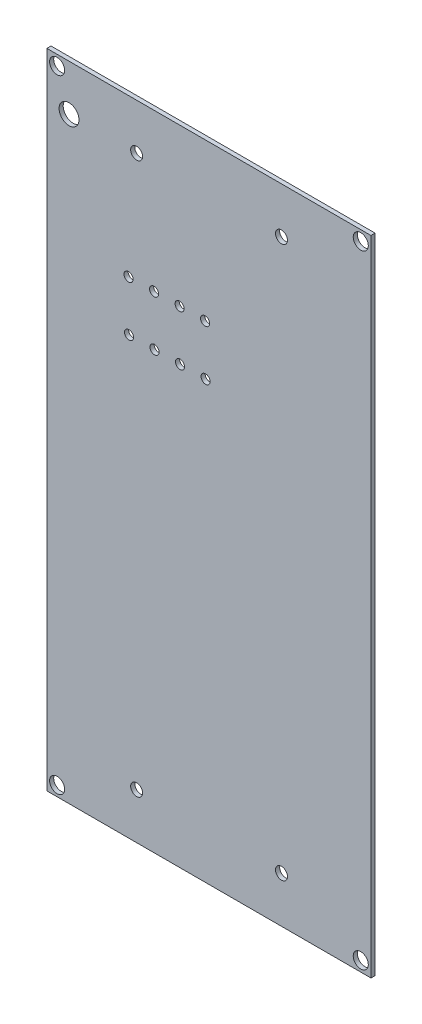
ISO-10303-21;
HEADER;
FILE_DESCRIPTION(('STEP AP214'),'2;1');
FILE_NAME('part.step','',(''),(''),'','','');
FILE_SCHEMA(('AUTOMOTIVE_DESIGN { 1 0 10303 214 1 1 1 1 }'));
ENDSEC;
DATA;
#1=APPLICATION_CONTEXT('core data for automotive mechanical design processes');
#2=APPLICATION_PROTOCOL_DEFINITION('international standard','automotive_design',2000,#1);
#3=PRODUCT_CONTEXT('',#1,'mechanical');
#4=PRODUCT('Part','Part','',(#3));
#5=PRODUCT_RELATED_PRODUCT_CATEGORY('part','',(#4));
#6=PRODUCT_DEFINITION_FORMATION('','',#4);
#7=PRODUCT_DEFINITION_CONTEXT('part definition',#1,'design');
#8=PRODUCT_DEFINITION('design','',#6,#7);
#9=PRODUCT_DEFINITION_SHAPE('','',#8);
#10=(LENGTH_UNIT() NAMED_UNIT(*) SI_UNIT(.MILLI.,.METRE.));
#11=(NAMED_UNIT(*) PLANE_ANGLE_UNIT() SI_UNIT($,.RADIAN.));
#12=(NAMED_UNIT(*) SI_UNIT($,.STERADIAN.) SOLID_ANGLE_UNIT());
#13=UNCERTAINTY_MEASURE_WITH_UNIT(LENGTH_MEASURE(1.E-05),#10,'distance_accuracy_value','');
#14=(GEOMETRIC_REPRESENTATION_CONTEXT(3) GLOBAL_UNCERTAINTY_ASSIGNED_CONTEXT((#13)) GLOBAL_UNIT_ASSIGNED_CONTEXT((#10,
#11,#12)) REPRESENTATION_CONTEXT('',''));
#15=CARTESIAN_POINT('',(0.,0.,0.));
#16=DIRECTION('',(0.,0.,1.));
#17=DIRECTION('',(1.,0.,0.));
#18=AXIS2_PLACEMENT_3D('',#15,#16,#17);
#19=CARTESIAN_POINT('',(4.82600021362305,1.26999998092651,0.));
#20=DIRECTION('',(-1.,0.,0.));
#21=DIRECTION('',(0.,1.,0.));
#22=AXIS2_PLACEMENT_3D('',#19,#20,#21);
#23=PLANE('',#22);
#24=DIRECTION('',(0.,0.,1.));
#25=VECTOR('',#24,1.);
#26=CARTESIAN_POINT('',(4.82600021362305,1.26999998092651,0.));
#27=LINE('',#26,#25);
#28=CARTESIAN_POINT('',(4.82600021362305,1.26999998092651,0.));
#29=VERTEX_POINT('',#28);
#30=CARTESIAN_POINT('',(4.82600021362305,1.26999998092651,0.41148));
#31=VERTEX_POINT('',#30);
#32=EDGE_CURVE('E11',#29,#31,#27,.T.);
#33=ORIENTED_EDGE('',*,*,#32,.T.);
#34=DIRECTION('',(0.,1.,0.));
#35=VECTOR('',#34,1.);
#36=CARTESIAN_POINT('',(4.82600021362305,1.26999998092651,0.41148));
#37=LINE('',#36,#35);
#38=CARTESIAN_POINT('',(4.82600021362305,64.0080032348633,0.41148));
#39=VERTEX_POINT('',#38);
#40=EDGE_CURVE('E24',#31,#39,#37,.T.);
#41=ORIENTED_EDGE('',*,*,#40,.T.);
#42=DIRECTION('',(0.,0.,1.));
#43=VECTOR('',#42,1.);
#44=CARTESIAN_POINT('',(4.82600021362305,64.0080032348633,0.));
#45=LINE('',#44,#43);
#46=CARTESIAN_POINT('',(4.82600021362305,64.0080032348633,0.));
#47=VERTEX_POINT('',#46);
#48=EDGE_CURVE('E335',#47,#39,#45,.T.);
#49=ORIENTED_EDGE('',*,*,#48,.F.);
#50=DIRECTION('',(0.,1.,0.));
#51=VECTOR('',#50,1.);
#52=CARTESIAN_POINT('',(4.82600021362305,1.26999998092651,0.));
#53=LINE('',#52,#51);
#54=EDGE_CURVE('E332',#29,#47,#53,.T.);
#55=ORIENTED_EDGE('',*,*,#54,.F.);
#56=EDGE_LOOP('',(#33,#41,#49,#55));
#57=FACE_BOUND('',#56,.T.);
#58=ADVANCED_FACE('F17',(#57),#23,.T.);
#59=CARTESIAN_POINT('',(4.82600021362305,64.0080032348633,0.));
#60=DIRECTION('',(0.,1.,0.));
#61=DIRECTION('',(1.,0.,0.));
#62=AXIS2_PLACEMENT_3D('',#59,#60,#61);
#63=PLANE('',#62);
#64=ORIENTED_EDGE('',*,*,#48,.T.);
#65=DIRECTION('',(1.,0.,0.));
#66=VECTOR('',#65,1.);
#67=CARTESIAN_POINT('',(4.82600021362305,64.0080032348633,0.41148));
#68=LINE('',#67,#66);
#69=CARTESIAN_POINT('',(37.0839996337891,64.0080032348633,0.41148));
#70=VERTEX_POINT('',#69);
#71=EDGE_CURVE('E329',#39,#70,#68,.T.);
#72=ORIENTED_EDGE('',*,*,#71,.T.);
#73=DIRECTION('',(0.,0.,1.));
#74=VECTOR('',#73,1.);
#75=CARTESIAN_POINT('',(37.0839996337891,64.0080032348633,0.));
#76=LINE('',#75,#74);
#77=CARTESIAN_POINT('',(37.0839996337891,64.0080032348633,0.));
#78=VERTEX_POINT('',#77);
#79=EDGE_CURVE('E327',#78,#70,#76,.T.);
#80=ORIENTED_EDGE('',*,*,#79,.F.);
#81=DIRECTION('',(1.,0.,0.));
#82=VECTOR('',#81,1.);
#83=CARTESIAN_POINT('',(4.82600021362305,64.0080032348633,0.));
#84=LINE('',#83,#82);
#85=EDGE_CURVE('E324',#47,#78,#84,.T.);
#86=ORIENTED_EDGE('',*,*,#85,.F.);
#87=EDGE_LOOP('',(#64,#72,#80,#86));
#88=FACE_BOUND('',#87,.T.);
#89=ADVANCED_FACE('F344',(#88),#63,.T.);
#90=CARTESIAN_POINT('',(37.0839996337891,64.0080032348633,0.));
#91=DIRECTION('',(1.,0.,0.));
#92=DIRECTION('',(0.,-1.,0.));
#93=AXIS2_PLACEMENT_3D('',#90,#91,#92);
#94=PLANE('',#93);
#95=ORIENTED_EDGE('',*,*,#79,.T.);
#96=DIRECTION('',(0.,-1.,0.));
#97=VECTOR('',#96,1.);
#98=CARTESIAN_POINT('',(37.0839996337891,64.0080032348633,0.41148));
#99=LINE('',#98,#97);
#100=CARTESIAN_POINT('',(37.0839996337891,0.,0.41148));
#101=VERTEX_POINT('',#100);
#102=EDGE_CURVE('E321',#70,#101,#99,.T.);
#103=ORIENTED_EDGE('',*,*,#102,.T.);
#104=DIRECTION('',(0.,0.,1.));
#105=VECTOR('',#104,1.);
#106=CARTESIAN_POINT('',(37.0839996337891,0.,0.));
#107=LINE('',#106,#105);
#108=CARTESIAN_POINT('',(37.0839996337891,0.,0.));
#109=VERTEX_POINT('',#108);
#110=EDGE_CURVE('E319',#109,#101,#107,.T.);
#111=ORIENTED_EDGE('',*,*,#110,.F.);
#112=DIRECTION('',(0.,-1.,0.));
#113=VECTOR('',#112,1.);
#114=CARTESIAN_POINT('',(37.0839996337891,64.0080032348633,0.));
#115=LINE('',#114,#113);
#116=EDGE_CURVE('E316',#78,#109,#115,.T.);
#117=ORIENTED_EDGE('',*,*,#116,.F.);
#118=EDGE_LOOP('',(#95,#103,#111,#117));
#119=FACE_BOUND('',#118,.T.);
#120=ADVANCED_FACE('F351',(#119),#94,.T.);
#121=CARTESIAN_POINT('',(37.0839996337891,0.,0.));
#122=DIRECTION('',(0.,-1.,0.));
#123=DIRECTION('',(-1.,0.,0.));
#124=AXIS2_PLACEMENT_3D('',#121,#122,#123);
#125=PLANE('',#124);
#126=ORIENTED_EDGE('',*,*,#110,.T.);
#127=DIRECTION('',(-1.,0.,0.));
#128=VECTOR('',#127,1.);
#129=CARTESIAN_POINT('',(37.0839996337891,0.,0.41148));
#130=LINE('',#129,#128);
#131=CARTESIAN_POINT('',(4.82600021362305,0.,0.41148));
#132=VERTEX_POINT('',#131);
#133=EDGE_CURVE('E313',#101,#132,#130,.T.);
#134=ORIENTED_EDGE('',*,*,#133,.T.);
#135=DIRECTION('',(0.,0.,1.));
#136=VECTOR('',#135,1.);
#137=CARTESIAN_POINT('',(4.82600021362305,0.,0.));
#138=LINE('',#137,#136);
#139=CARTESIAN_POINT('',(4.82600021362305,0.,0.));
#140=VERTEX_POINT('',#139);
#141=EDGE_CURVE('E311',#140,#132,#138,.T.);
#142=ORIENTED_EDGE('',*,*,#141,.F.);
#143=DIRECTION('',(-1.,0.,0.));
#144=VECTOR('',#143,1.);
#145=CARTESIAN_POINT('',(37.0839996337891,0.,0.));
#146=LINE('',#145,#144);
#147=EDGE_CURVE('E308',#109,#140,#146,.T.);
#148=ORIENTED_EDGE('',*,*,#147,.F.);
#149=EDGE_LOOP('',(#126,#134,#142,#148));
#150=FACE_BOUND('',#149,.T.);
#151=ADVANCED_FACE('F353',(#150),#125,.T.);
#152=CARTESIAN_POINT('',(4.82600021362305,0.,0.));
#153=DIRECTION('',(-1.,0.,0.));
#154=DIRECTION('',(0.,1.,0.));
#155=AXIS2_PLACEMENT_3D('',#152,#153,#154);
#156=PLANE('',#155);
#157=ORIENTED_EDGE('',*,*,#141,.T.);
#158=DIRECTION('',(0.,1.,0.));
#159=VECTOR('',#158,1.);
#160=CARTESIAN_POINT('',(4.82600021362305,0.,0.41148));
#161=LINE('',#160,#159);
#162=EDGE_CURVE('E306',#132,#31,#161,.T.);
#163=ORIENTED_EDGE('',*,*,#162,.T.);
#164=ORIENTED_EDGE('',*,*,#32,.F.);
#165=DIRECTION('',(0.,1.,0.));
#166=VECTOR('',#165,1.);
#167=CARTESIAN_POINT('',(4.82600021362305,0.,0.));
#168=LINE('',#167,#166);
#169=EDGE_CURVE('E303',#140,#29,#168,.T.);
#170=ORIENTED_EDGE('',*,*,#169,.F.);
#171=EDGE_LOOP('',(#157,#163,#164,#170));
#172=FACE_BOUND('',#171,.T.);
#173=ADVANCED_FACE('F354',(#172),#156,.T.);
#174=CARTESIAN_POINT('',(5.84198475999999,1.01598476,0.));
#175=DIRECTION('',(0.,0.,-1.));
#176=DIRECTION('',(1.,0.,0.));
#177=AXIS2_PLACEMENT_3D('',#174,#175,#176);
#178=CYLINDRICAL_SURFACE('',#177,0.7499985);
#179=DIRECTION('',(0.,0.,1.));
#180=VECTOR('',#179,1.);
#181=CARTESIAN_POINT('',(6.59198325999999,1.01598476,0.));
#182=LINE('',#181,#180);
#183=CARTESIAN_POINT('',(6.59198325999999,1.01598476,0.));
#184=VERTEX_POINT('',#183);
#185=CARTESIAN_POINT('',(6.59198325999999,1.01598476,0.41148));
#186=VERTEX_POINT('',#185);
#187=EDGE_CURVE('E301',#184,#186,#182,.T.);
#188=ORIENTED_EDGE('',*,*,#187,.T.);
#189=CARTESIAN_POINT('',(5.84198475999999,1.01598476,0.41148));
#190=DIRECTION('',(0.,0.,1.));
#191=DIRECTION('',(1.,0.,0.));
#192=AXIS2_PLACEMENT_3D('',#189,#190,#191);
#193=CIRCLE('',#192,0.7499985);
#194=EDGE_CURVE('E298',#186,#186,#193,.T.);
#195=ORIENTED_EDGE('',*,*,#194,.T.);
#196=ORIENTED_EDGE('',*,*,#187,.F.);
#197=CARTESIAN_POINT('',(5.84198475999999,1.01598476,0.));
#198=DIRECTION('',(0.,0.,1.));
#199=DIRECTION('',(1.,0.,0.));
#200=AXIS2_PLACEMENT_3D('',#197,#198,#199);
#201=CIRCLE('',#200,0.7499985);
#202=EDGE_CURVE('E295',#184,#184,#201,.T.);
#203=ORIENTED_EDGE('',*,*,#202,.F.);
#204=EDGE_LOOP('',(#188,#195,#196,#203));
#205=FACE_BOUND('',#204,.T.);
#206=ADVANCED_FACE('F356',(#205),#178,.F.);
#207=CARTESIAN_POINT('',(12.95403556,48.38703556,0.));
#208=DIRECTION('',(0.,0.,-1.));
#209=DIRECTION('',(1.,0.,0.));
#210=AXIS2_PLACEMENT_3D('',#207,#208,#209);
#211=CYLINDRICAL_SURFACE('',#210,0.4499991);
#212=DIRECTION('',(0.,0.,1.));
#213=VECTOR('',#212,1.);
#214=CARTESIAN_POINT('',(13.40403466,48.38703556,0.));
#215=LINE('',#214,#213);
#216=CARTESIAN_POINT('',(13.40403466,48.38703556,0.));
#217=VERTEX_POINT('',#216);
#218=CARTESIAN_POINT('',(13.40403466,48.38703556,0.41148));
#219=VERTEX_POINT('',#218);
#220=EDGE_CURVE('E293',#217,#219,#215,.T.);
#221=ORIENTED_EDGE('',*,*,#220,.T.);
#222=CARTESIAN_POINT('',(12.95403556,48.38703556,0.41148));
#223=DIRECTION('',(0.,0.,1.));
#224=DIRECTION('',(1.,0.,0.));
#225=AXIS2_PLACEMENT_3D('',#222,#223,#224);
#226=CIRCLE('',#225,0.4499991);
#227=EDGE_CURVE('E290',#219,#219,#226,.T.);
#228=ORIENTED_EDGE('',*,*,#227,.T.);
#229=ORIENTED_EDGE('',*,*,#220,.F.);
#230=CARTESIAN_POINT('',(12.95403556,48.38703556,0.));
#231=DIRECTION('',(0.,0.,1.));
#232=DIRECTION('',(1.,0.,0.));
#233=AXIS2_PLACEMENT_3D('',#230,#231,#232);
#234=CIRCLE('',#233,0.4499991);
#235=EDGE_CURVE('E287',#217,#217,#234,.T.);
#236=ORIENTED_EDGE('',*,*,#235,.F.);
#237=EDGE_LOOP('',(#221,#228,#229,#236));
#238=FACE_BOUND('',#237,.T.);
#239=ADVANCED_FACE('F363',(#238),#211,.F.);
#240=CARTESIAN_POINT('',(13.75835196,4.57772516,0.));
#241=DIRECTION('',(0.,0.,-1.));
#242=DIRECTION('',(1.,0.,0.));
#243=AXIS2_PLACEMENT_3D('',#240,#241,#242);
#244=CYLINDRICAL_SURFACE('',#243,0.59500008);
#245=DIRECTION('',(0.,0.,1.));
#246=VECTOR('',#245,1.);
#247=CARTESIAN_POINT('',(14.35335204,4.57772516,0.));
#248=LINE('',#247,#246);
#249=CARTESIAN_POINT('',(14.35335204,4.57772516,0.));
#250=VERTEX_POINT('',#249);
#251=CARTESIAN_POINT('',(14.35335204,4.57772516,0.41148));
#252=VERTEX_POINT('',#251);
#253=EDGE_CURVE('E285',#250,#252,#248,.T.);
#254=ORIENTED_EDGE('',*,*,#253,.T.);
#255=CARTESIAN_POINT('',(13.75835196,4.57772516,0.41148));
#256=DIRECTION('',(0.,0.,1.));
#257=DIRECTION('',(1.,0.,0.));
#258=AXIS2_PLACEMENT_3D('',#255,#256,#257);
#259=CIRCLE('',#258,0.59500008);
#260=EDGE_CURVE('E282',#252,#252,#259,.T.);
#261=ORIENTED_EDGE('',*,*,#260,.T.);
#262=ORIENTED_EDGE('',*,*,#253,.F.);
#263=CARTESIAN_POINT('',(13.75835196,4.57772516,0.));
#264=DIRECTION('',(0.,0.,1.));
#265=DIRECTION('',(1.,0.,0.));
#266=AXIS2_PLACEMENT_3D('',#263,#264,#265);
#267=CIRCLE('',#266,0.59500008);
#268=EDGE_CURVE('E279',#250,#250,#267,.T.);
#269=ORIENTED_EDGE('',*,*,#268,.F.);
#270=EDGE_LOOP('',(#254,#261,#262,#269));
#271=FACE_BOUND('',#270,.T.);
#272=ADVANCED_FACE('F408',(#271),#244,.F.);
#273=CARTESIAN_POINT('',(13.00000956,43.39999956,0.));
#274=DIRECTION('',(0.,0.,-1.));
#275=DIRECTION('',(1.,0.,0.));
#276=AXIS2_PLACEMENT_3D('',#273,#274,#275);
#277=CYLINDRICAL_SURFACE('',#276,0.4499991);
#278=DIRECTION('',(0.,0.,1.));
#279=VECTOR('',#278,1.);
#280=CARTESIAN_POINT('',(13.45000866,43.39999956,0.));
#281=LINE('',#280,#279);
#282=CARTESIAN_POINT('',(13.45000866,43.39999956,0.));
#283=VERTEX_POINT('',#282);
#284=CARTESIAN_POINT('',(13.45000866,43.39999956,0.41148));
#285=VERTEX_POINT('',#284);
#286=EDGE_CURVE('E277',#283,#285,#281,.T.);
#287=ORIENTED_EDGE('',*,*,#286,.T.);
#288=CARTESIAN_POINT('',(13.00000956,43.39999956,0.41148));
#289=DIRECTION('',(0.,0.,1.));
#290=DIRECTION('',(1.,0.,0.));
#291=AXIS2_PLACEMENT_3D('',#288,#289,#290);
#292=CIRCLE('',#291,0.4499991);
#293=EDGE_CURVE('E274',#285,#285,#292,.T.);
#294=ORIENTED_EDGE('',*,*,#293,.T.);
#295=ORIENTED_EDGE('',*,*,#286,.F.);
#296=CARTESIAN_POINT('',(13.00000956,43.39999956,0.));
#297=DIRECTION('',(0.,0.,1.));
#298=DIRECTION('',(1.,0.,0.));
#299=AXIS2_PLACEMENT_3D('',#296,#297,#298);
#300=CIRCLE('',#299,0.4499991);
#301=EDGE_CURVE('E271',#283,#283,#300,.T.);
#302=ORIENTED_EDGE('',*,*,#301,.F.);
#303=EDGE_LOOP('',(#287,#294,#295,#302));
#304=FACE_BOUND('',#303,.T.);
#305=ADVANCED_FACE('F418',(#304),#277,.F.);
#306=CARTESIAN_POINT('',(7.02836795999998,59.43776276,0.));
#307=DIRECTION('',(0.,0.,-1.));
#308=DIRECTION('',(1.,0.,0.));
#309=AXIS2_PLACEMENT_3D('',#306,#307,#308);
#310=CYLINDRICAL_SURFACE('',#309,0.99000056);
#311=DIRECTION('',(0.,0.,1.));
#312=VECTOR('',#311,1.);
#313=CARTESIAN_POINT('',(8.01836851999998,59.43776276,0.));
#314=LINE('',#313,#312);
#315=CARTESIAN_POINT('',(8.01836851999998,59.43776276,0.));
#316=VERTEX_POINT('',#315);
#317=CARTESIAN_POINT('',(8.01836851999998,59.43776276,0.41148));
#318=VERTEX_POINT('',#317);
#319=EDGE_CURVE('E269',#316,#318,#314,.T.);
#320=ORIENTED_EDGE('',*,*,#319,.T.);
#321=CARTESIAN_POINT('',(7.02836795999998,59.43776276,0.41148));
#322=DIRECTION('',(0.,0.,1.));
#323=DIRECTION('',(1.,0.,0.));
#324=AXIS2_PLACEMENT_3D('',#321,#322,#323);
#325=CIRCLE('',#324,0.99000056);
#326=EDGE_CURVE('E266',#318,#318,#325,.T.);
#327=ORIENTED_EDGE('',*,*,#326,.T.);
#328=ORIENTED_EDGE('',*,*,#319,.F.);
#329=CARTESIAN_POINT('',(7.02836795999998,59.43776276,0.));
#330=DIRECTION('',(0.,0.,1.));
#331=DIRECTION('',(1.,0.,0.));
#332=AXIS2_PLACEMENT_3D('',#329,#330,#331);
#333=CIRCLE('',#332,0.99000056);
#334=EDGE_CURVE('E263',#316,#316,#333,.T.);
#335=ORIENTED_EDGE('',*,*,#334,.F.);
#336=EDGE_LOOP('',(#320,#327,#328,#335));
#337=FACE_BOUND('',#336,.T.);
#338=ADVANCED_FACE('F428',(#337),#310,.F.);
#339=CARTESIAN_POINT('',(5.84198475999999,62.99198476,0.));
#340=DIRECTION('',(0.,0.,-1.));
#341=DIRECTION('',(1.,0.,0.));
#342=AXIS2_PLACEMENT_3D('',#339,#340,#341);
#343=CYLINDRICAL_SURFACE('',#342,0.7499985);
#344=DIRECTION('',(0.,0.,1.));
#345=VECTOR('',#344,1.);
#346=CARTESIAN_POINT('',(6.59198325999999,62.99198476,0.));
#347=LINE('',#346,#345);
#348=CARTESIAN_POINT('',(6.59198325999999,62.99198476,0.));
#349=VERTEX_POINT('',#348);
#350=CARTESIAN_POINT('',(6.59198325999999,62.99198476,0.41148));
#351=VERTEX_POINT('',#350);
#352=EDGE_CURVE('E261',#349,#351,#347,.T.);
#353=ORIENTED_EDGE('',*,*,#352,.T.);
#354=CARTESIAN_POINT('',(5.84198475999999,62.99198476,0.41148));
#355=DIRECTION('',(0.,0.,1.));
#356=DIRECTION('',(1.,0.,0.));
#357=AXIS2_PLACEMENT_3D('',#354,#355,#356);
#358=CIRCLE('',#357,0.7499985);
#359=EDGE_CURVE('E258',#351,#351,#358,.T.);
#360=ORIENTED_EDGE('',*,*,#359,.T.);
#361=ORIENTED_EDGE('',*,*,#352,.F.);
#362=CARTESIAN_POINT('',(5.84198475999999,62.99198476,0.));
#363=DIRECTION('',(0.,0.,1.));
#364=DIRECTION('',(1.,0.,0.));
#365=AXIS2_PLACEMENT_3D('',#362,#363,#364);
#366=CIRCLE('',#365,0.7499985);
#367=EDGE_CURVE('E255',#349,#349,#366,.T.);
#368=ORIENTED_EDGE('',*,*,#367,.F.);
#369=EDGE_LOOP('',(#353,#360,#361,#368));
#370=FACE_BOUND('',#369,.T.);
#371=ADVANCED_FACE('F438',(#370),#343,.F.);
#372=CARTESIAN_POINT('',(15.49403556,48.38703556,0.));
#373=DIRECTION('',(0.,0.,-1.));
#374=DIRECTION('',(1.,0.,0.));
#375=AXIS2_PLACEMENT_3D('',#372,#373,#374);
#376=CYLINDRICAL_SURFACE('',#375,0.4499991);
#377=DIRECTION('',(0.,0.,1.));
#378=VECTOR('',#377,1.);
#379=CARTESIAN_POINT('',(15.94403466,48.38703556,0.));
#380=LINE('',#379,#378);
#381=CARTESIAN_POINT('',(15.94403466,48.38703556,0.));
#382=VERTEX_POINT('',#381);
#383=CARTESIAN_POINT('',(15.94403466,48.38703556,0.41148));
#384=VERTEX_POINT('',#383);
#385=EDGE_CURVE('E253',#382,#384,#380,.T.);
#386=ORIENTED_EDGE('',*,*,#385,.T.);
#387=CARTESIAN_POINT('',(15.49403556,48.38703556,0.41148));
#388=DIRECTION('',(0.,0.,1.));
#389=DIRECTION('',(1.,0.,0.));
#390=AXIS2_PLACEMENT_3D('',#387,#388,#389);
#391=CIRCLE('',#390,0.4499991);
#392=EDGE_CURVE('E250',#384,#384,#391,.T.);
#393=ORIENTED_EDGE('',*,*,#392,.T.);
#394=ORIENTED_EDGE('',*,*,#385,.F.);
#395=CARTESIAN_POINT('',(15.49403556,48.38703556,0.));
#396=DIRECTION('',(0.,0.,1.));
#397=DIRECTION('',(1.,0.,0.));
#398=AXIS2_PLACEMENT_3D('',#395,#396,#397);
#399=CIRCLE('',#398,0.4499991);
#400=EDGE_CURVE('E247',#382,#382,#399,.T.);
#401=ORIENTED_EDGE('',*,*,#400,.F.);
#402=EDGE_LOOP('',(#386,#393,#394,#401));
#403=FACE_BOUND('',#402,.T.);
#404=ADVANCED_FACE('F448',(#403),#376,.F.);
#405=CARTESIAN_POINT('',(13.75835196,59.43776276,0.));
#406=DIRECTION('',(0.,0.,-1.));
#407=DIRECTION('',(1.,0.,0.));
#408=AXIS2_PLACEMENT_3D('',#405,#406,#407);
#409=CYLINDRICAL_SURFACE('',#408,0.59500008);
#410=DIRECTION('',(0.,0.,1.));
#411=VECTOR('',#410,1.);
#412=CARTESIAN_POINT('',(14.35335204,59.43776276,0.));
#413=LINE('',#412,#411);
#414=CARTESIAN_POINT('',(14.35335204,59.43776276,0.));
#415=VERTEX_POINT('',#414);
#416=CARTESIAN_POINT('',(14.35335204,59.43776276,0.41148));
#417=VERTEX_POINT('',#416);
#418=EDGE_CURVE('E245',#415,#417,#413,.T.);
#419=ORIENTED_EDGE('',*,*,#418,.T.);
#420=CARTESIAN_POINT('',(13.75835196,59.43776276,0.41148));
#421=DIRECTION('',(0.,0.,1.));
#422=DIRECTION('',(1.,0.,0.));
#423=AXIS2_PLACEMENT_3D('',#420,#421,#422);
#424=CIRCLE('',#423,0.59500008);
#425=EDGE_CURVE('E242',#417,#417,#424,.T.);
#426=ORIENTED_EDGE('',*,*,#425,.T.);
#427=ORIENTED_EDGE('',*,*,#418,.F.);
#428=CARTESIAN_POINT('',(13.75835196,59.43776276,0.));
#429=DIRECTION('',(0.,0.,1.));
#430=DIRECTION('',(1.,0.,0.));
#431=AXIS2_PLACEMENT_3D('',#428,#429,#430);
#432=CIRCLE('',#431,0.59500008);
#433=EDGE_CURVE('E239',#415,#415,#432,.T.);
#434=ORIENTED_EDGE('',*,*,#433,.F.);
#435=EDGE_LOOP('',(#419,#426,#427,#434));
#436=FACE_BOUND('',#435,.T.);
#437=ADVANCED_FACE('F458',(#436),#409,.F.);
#438=CARTESIAN_POINT('',(18.08000956,43.39999956,0.));
#439=DIRECTION('',(0.,0.,-1.));
#440=DIRECTION('',(1.,0.,0.));
#441=AXIS2_PLACEMENT_3D('',#438,#439,#440);
#442=CYLINDRICAL_SURFACE('',#441,0.4499991);
#443=DIRECTION('',(0.,0.,1.));
#444=VECTOR('',#443,1.);
#445=CARTESIAN_POINT('',(18.53000866,43.39999956,0.));
#446=LINE('',#445,#444);
#447=CARTESIAN_POINT('',(18.53000866,43.39999956,0.));
#448=VERTEX_POINT('',#447);
#449=CARTESIAN_POINT('',(18.53000866,43.39999956,0.41148));
#450=VERTEX_POINT('',#449);
#451=EDGE_CURVE('E237',#448,#450,#446,.T.);
#452=ORIENTED_EDGE('',*,*,#451,.T.);
#453=CARTESIAN_POINT('',(18.08000956,43.39999956,0.41148));
#454=DIRECTION('',(0.,0.,1.));
#455=DIRECTION('',(1.,0.,0.));
#456=AXIS2_PLACEMENT_3D('',#453,#454,#455);
#457=CIRCLE('',#456,0.4499991);
#458=EDGE_CURVE('E234',#450,#450,#457,.T.);
#459=ORIENTED_EDGE('',*,*,#458,.T.);
#460=ORIENTED_EDGE('',*,*,#451,.F.);
#461=CARTESIAN_POINT('',(18.08000956,43.39999956,0.));
#462=DIRECTION('',(0.,0.,1.));
#463=DIRECTION('',(1.,0.,0.));
#464=AXIS2_PLACEMENT_3D('',#461,#462,#463);
#465=CIRCLE('',#464,0.4499991);
#466=EDGE_CURVE('E231',#448,#448,#465,.T.);
#467=ORIENTED_EDGE('',*,*,#466,.F.);
#468=EDGE_LOOP('',(#452,#459,#460,#467));
#469=FACE_BOUND('',#468,.T.);
#470=ADVANCED_FACE('F468',(#469),#442,.F.);
#471=CARTESIAN_POINT('',(15.54000956,43.39999956,0.));
#472=DIRECTION('',(0.,0.,-1.));
#473=DIRECTION('',(1.,0.,0.));
#474=AXIS2_PLACEMENT_3D('',#471,#472,#473);
#475=CYLINDRICAL_SURFACE('',#474,0.4499991);
#476=DIRECTION('',(0.,0.,1.));
#477=VECTOR('',#476,1.);
#478=CARTESIAN_POINT('',(15.99000866,43.39999956,0.));
#479=LINE('',#478,#477);
#480=CARTESIAN_POINT('',(15.99000866,43.39999956,0.));
#481=VERTEX_POINT('',#480);
#482=CARTESIAN_POINT('',(15.99000866,43.39999956,0.41148));
#483=VERTEX_POINT('',#482);
#484=EDGE_CURVE('E229',#481,#483,#479,.T.);
#485=ORIENTED_EDGE('',*,*,#484,.T.);
#486=CARTESIAN_POINT('',(15.54000956,43.39999956,0.41148));
#487=DIRECTION('',(0.,0.,1.));
#488=DIRECTION('',(1.,0.,0.));
#489=AXIS2_PLACEMENT_3D('',#486,#487,#488);
#490=CIRCLE('',#489,0.4499991);
#491=EDGE_CURVE('E226',#483,#483,#490,.T.);
#492=ORIENTED_EDGE('',*,*,#491,.T.);
#493=ORIENTED_EDGE('',*,*,#484,.F.);
#494=CARTESIAN_POINT('',(15.54000956,43.39999956,0.));
#495=DIRECTION('',(0.,0.,1.));
#496=DIRECTION('',(1.,0.,0.));
#497=AXIS2_PLACEMENT_3D('',#494,#495,#496);
#498=CIRCLE('',#497,0.4499991);
#499=EDGE_CURVE('E223',#481,#481,#498,.T.);
#500=ORIENTED_EDGE('',*,*,#499,.F.);
#501=EDGE_LOOP('',(#485,#492,#493,#500));
#502=FACE_BOUND('',#501,.T.);
#503=ADVANCED_FACE('F478',(#502),#475,.F.);
#504=CARTESIAN_POINT('',(36.06798476,1.01598476,0.));
#505=DIRECTION('',(0.,0.,-1.));
#506=DIRECTION('',(1.,0.,0.));
#507=AXIS2_PLACEMENT_3D('',#504,#505,#506);
#508=CYLINDRICAL_SURFACE('',#507,0.7499985);
#509=DIRECTION('',(0.,0.,1.));
#510=VECTOR('',#509,1.);
#511=CARTESIAN_POINT('',(36.81798326,1.01598476,0.));
#512=LINE('',#511,#510);
#513=CARTESIAN_POINT('',(36.81798326,1.01598476,0.));
#514=VERTEX_POINT('',#513);
#515=CARTESIAN_POINT('',(36.81798326,1.01598476,0.41148));
#516=VERTEX_POINT('',#515);
#517=EDGE_CURVE('E221',#514,#516,#512,.T.);
#518=ORIENTED_EDGE('',*,*,#517,.T.);
#519=CARTESIAN_POINT('',(36.06798476,1.01598476,0.41148));
#520=DIRECTION('',(0.,0.,1.));
#521=DIRECTION('',(1.,0.,0.));
#522=AXIS2_PLACEMENT_3D('',#519,#520,#521);
#523=CIRCLE('',#522,0.7499985);
#524=EDGE_CURVE('E218',#516,#516,#523,.T.);
#525=ORIENTED_EDGE('',*,*,#524,.T.);
#526=ORIENTED_EDGE('',*,*,#517,.F.);
#527=CARTESIAN_POINT('',(36.06798476,1.01598476,0.));
#528=DIRECTION('',(0.,0.,1.));
#529=DIRECTION('',(1.,0.,0.));
#530=AXIS2_PLACEMENT_3D('',#527,#528,#529);
#531=CIRCLE('',#530,0.7499985);
#532=EDGE_CURVE('E215',#514,#514,#531,.T.);
#533=ORIENTED_EDGE('',*,*,#532,.F.);
#534=EDGE_LOOP('',(#518,#525,#526,#533));
#535=FACE_BOUND('',#534,.T.);
#536=ADVANCED_FACE('F488',(#535),#508,.F.);
#537=CARTESIAN_POINT('',(28.17838916,4.57772516,0.));
#538=DIRECTION('',(0.,0.,-1.));
#539=DIRECTION('',(1.,0.,0.));
#540=AXIS2_PLACEMENT_3D('',#537,#538,#539);
#541=CYLINDRICAL_SURFACE('',#540,0.59500008);
#542=DIRECTION('',(0.,0.,1.));
#543=VECTOR('',#542,1.);
#544=CARTESIAN_POINT('',(28.77338924,4.57772516,0.));
#545=LINE('',#544,#543);
#546=CARTESIAN_POINT('',(28.77338924,4.57772516,0.));
#547=VERTEX_POINT('',#546);
#548=CARTESIAN_POINT('',(28.77338924,4.57772516,0.41148));
#549=VERTEX_POINT('',#548);
#550=EDGE_CURVE('E213',#547,#549,#545,.T.);
#551=ORIENTED_EDGE('',*,*,#550,.T.);
#552=CARTESIAN_POINT('',(28.17838916,4.57772516,0.41148));
#553=DIRECTION('',(0.,0.,1.));
#554=DIRECTION('',(1.,0.,0.));
#555=AXIS2_PLACEMENT_3D('',#552,#553,#554);
#556=CIRCLE('',#555,0.59500008);
#557=EDGE_CURVE('E210',#549,#549,#556,.T.);
#558=ORIENTED_EDGE('',*,*,#557,.T.);
#559=ORIENTED_EDGE('',*,*,#550,.F.);
#560=CARTESIAN_POINT('',(28.17838916,4.57772516,0.));
#561=DIRECTION('',(0.,0.,1.));
#562=DIRECTION('',(1.,0.,0.));
#563=AXIS2_PLACEMENT_3D('',#560,#561,#562);
#564=CIRCLE('',#563,0.59500008);
#565=EDGE_CURVE('E207',#547,#547,#564,.T.);
#566=ORIENTED_EDGE('',*,*,#565,.F.);
#567=EDGE_LOOP('',(#551,#558,#559,#566));
#568=FACE_BOUND('',#567,.T.);
#569=ADVANCED_FACE('F498',(#568),#541,.F.);
#570=CARTESIAN_POINT('',(20.57403556,48.38703556,0.));
#571=DIRECTION('',(0.,0.,-1.));
#572=DIRECTION('',(1.,0.,0.));
#573=AXIS2_PLACEMENT_3D('',#570,#571,#572);
#574=CYLINDRICAL_SURFACE('',#573,0.4499991);
#575=DIRECTION('',(0.,0.,1.));
#576=VECTOR('',#575,1.);
#577=CARTESIAN_POINT('',(21.02403466,48.38703556,0.));
#578=LINE('',#577,#576);
#579=CARTESIAN_POINT('',(21.02403466,48.38703556,0.));
#580=VERTEX_POINT('',#579);
#581=CARTESIAN_POINT('',(21.02403466,48.38703556,0.41148));
#582=VERTEX_POINT('',#581);
#583=EDGE_CURVE('E205',#580,#582,#578,.T.);
#584=ORIENTED_EDGE('',*,*,#583,.T.);
#585=CARTESIAN_POINT('',(20.57403556,48.38703556,0.41148));
#586=DIRECTION('',(0.,0.,1.));
#587=DIRECTION('',(1.,0.,0.));
#588=AXIS2_PLACEMENT_3D('',#585,#586,#587);
#589=CIRCLE('',#588,0.4499991);
#590=EDGE_CURVE('E202',#582,#582,#589,.T.);
#591=ORIENTED_EDGE('',*,*,#590,.T.);
#592=ORIENTED_EDGE('',*,*,#583,.F.);
#593=CARTESIAN_POINT('',(20.57403556,48.38703556,0.));
#594=DIRECTION('',(0.,0.,1.));
#595=DIRECTION('',(1.,0.,0.));
#596=AXIS2_PLACEMENT_3D('',#593,#594,#595);
#597=CIRCLE('',#596,0.4499991);
#598=EDGE_CURVE('E199',#580,#580,#597,.T.);
#599=ORIENTED_EDGE('',*,*,#598,.F.);
#600=EDGE_LOOP('',(#584,#591,#592,#599));
#601=FACE_BOUND('',#600,.T.);
#602=ADVANCED_FACE('F508',(#601),#574,.F.);
#603=CARTESIAN_POINT('',(18.03403556,48.38703556,0.));
#604=DIRECTION('',(0.,0.,-1.));
#605=DIRECTION('',(1.,0.,0.));
#606=AXIS2_PLACEMENT_3D('',#603,#604,#605);
#607=CYLINDRICAL_SURFACE('',#606,0.4499991);
#608=DIRECTION('',(0.,0.,1.));
#609=VECTOR('',#608,1.);
#610=CARTESIAN_POINT('',(18.48403466,48.38703556,0.));
#611=LINE('',#610,#609);
#612=CARTESIAN_POINT('',(18.48403466,48.38703556,0.));
#613=VERTEX_POINT('',#612);
#614=CARTESIAN_POINT('',(18.48403466,48.38703556,0.41148));
#615=VERTEX_POINT('',#614);
#616=EDGE_CURVE('E197',#613,#615,#611,.T.);
#617=ORIENTED_EDGE('',*,*,#616,.T.);
#618=CARTESIAN_POINT('',(18.03403556,48.38703556,0.41148));
#619=DIRECTION('',(0.,0.,1.));
#620=DIRECTION('',(1.,0.,0.));
#621=AXIS2_PLACEMENT_3D('',#618,#619,#620);
#622=CIRCLE('',#621,0.4499991);
#623=EDGE_CURVE('E194',#615,#615,#622,.T.);
#624=ORIENTED_EDGE('',*,*,#623,.T.);
#625=ORIENTED_EDGE('',*,*,#616,.F.);
#626=CARTESIAN_POINT('',(18.03403556,48.38703556,0.));
#627=DIRECTION('',(0.,0.,1.));
#628=DIRECTION('',(1.,0.,0.));
#629=AXIS2_PLACEMENT_3D('',#626,#627,#628);
#630=CIRCLE('',#629,0.4499991);
#631=EDGE_CURVE('E191',#613,#613,#630,.T.);
#632=ORIENTED_EDGE('',*,*,#631,.F.);
#633=EDGE_LOOP('',(#617,#624,#625,#632));
#634=FACE_BOUND('',#633,.T.);
#635=ADVANCED_FACE('F518',(#634),#607,.F.);
#636=CARTESIAN_POINT('',(20.62000956,43.39999956,0.));
#637=DIRECTION('',(0.,0.,-1.));
#638=DIRECTION('',(1.,0.,0.));
#639=AXIS2_PLACEMENT_3D('',#636,#637,#638);
#640=CYLINDRICAL_SURFACE('',#639,0.4499991);
#641=DIRECTION('',(0.,0.,1.));
#642=VECTOR('',#641,1.);
#643=CARTESIAN_POINT('',(21.07000866,43.39999956,0.));
#644=LINE('',#643,#642);
#645=CARTESIAN_POINT('',(21.07000866,43.39999956,0.));
#646=VERTEX_POINT('',#645);
#647=CARTESIAN_POINT('',(21.07000866,43.39999956,0.41148));
#648=VERTEX_POINT('',#647);
#649=EDGE_CURVE('E189',#646,#648,#644,.T.);
#650=ORIENTED_EDGE('',*,*,#649,.T.);
#651=CARTESIAN_POINT('',(20.62000956,43.39999956,0.41148));
#652=DIRECTION('',(0.,0.,1.));
#653=DIRECTION('',(1.,0.,0.));
#654=AXIS2_PLACEMENT_3D('',#651,#652,#653);
#655=CIRCLE('',#654,0.4499991);
#656=EDGE_CURVE('E186',#648,#648,#655,.T.);
#657=ORIENTED_EDGE('',*,*,#656,.T.);
#658=ORIENTED_EDGE('',*,*,#649,.F.);
#659=CARTESIAN_POINT('',(20.62000956,43.39999956,0.));
#660=DIRECTION('',(0.,0.,1.));
#661=DIRECTION('',(1.,0.,0.));
#662=AXIS2_PLACEMENT_3D('',#659,#660,#661);
#663=CIRCLE('',#662,0.4499991);
#664=EDGE_CURVE('E183',#646,#646,#663,.T.);
#665=ORIENTED_EDGE('',*,*,#664,.F.);
#666=EDGE_LOOP('',(#650,#657,#658,#665));
#667=FACE_BOUND('',#666,.T.);
#668=ADVANCED_FACE('F528',(#667),#640,.F.);
#669=CARTESIAN_POINT('',(28.17838916,59.43776276,0.));
#670=DIRECTION('',(0.,0.,-1.));
#671=DIRECTION('',(1.,0.,0.));
#672=AXIS2_PLACEMENT_3D('',#669,#670,#671);
#673=CYLINDRICAL_SURFACE('',#672,0.59500008);
#674=DIRECTION('',(0.,0.,1.));
#675=VECTOR('',#674,1.);
#676=CARTESIAN_POINT('',(28.77338924,59.43776276,0.));
#677=LINE('',#676,#675);
#678=CARTESIAN_POINT('',(28.77338924,59.43776276,0.));
#679=VERTEX_POINT('',#678);
#680=CARTESIAN_POINT('',(28.77338924,59.43776276,0.41148));
#681=VERTEX_POINT('',#680);
#682=EDGE_CURVE('E181',#679,#681,#677,.T.);
#683=ORIENTED_EDGE('',*,*,#682,.T.);
#684=CARTESIAN_POINT('',(28.17838916,59.43776276,0.41148));
#685=DIRECTION('',(0.,0.,1.));
#686=DIRECTION('',(1.,0.,0.));
#687=AXIS2_PLACEMENT_3D('',#684,#685,#686);
#688=CIRCLE('',#687,0.59500008);
#689=EDGE_CURVE('E178',#681,#681,#688,.T.);
#690=ORIENTED_EDGE('',*,*,#689,.T.);
#691=ORIENTED_EDGE('',*,*,#682,.F.);
#692=CARTESIAN_POINT('',(28.17838916,59.43776276,0.));
#693=DIRECTION('',(0.,0.,1.));
#694=DIRECTION('',(1.,0.,0.));
#695=AXIS2_PLACEMENT_3D('',#692,#693,#694);
#696=CIRCLE('',#695,0.59500008);
#697=EDGE_CURVE('E169',#679,#679,#696,.T.);
#698=ORIENTED_EDGE('',*,*,#697,.F.);
#699=EDGE_LOOP('',(#683,#690,#691,#698));
#700=FACE_BOUND('',#699,.T.);
#701=ADVANCED_FACE('F538',(#700),#673,.F.);
#702=CARTESIAN_POINT('',(36.06798476,62.99198476,0.));
#703=DIRECTION('',(0.,0.,-1.));
#704=DIRECTION('',(1.,0.,0.));
#705=AXIS2_PLACEMENT_3D('',#702,#703,#704);
#706=CYLINDRICAL_SURFACE('',#705,0.7499985);
#707=DIRECTION('',(0.,0.,1.));
#708=VECTOR('',#707,1.);
#709=CARTESIAN_POINT('',(36.81798326,62.99198476,0.));
#710=LINE('',#709,#708);
#711=CARTESIAN_POINT('',(36.81798326,62.99198476,0.));
#712=VERTEX_POINT('',#711);
#713=CARTESIAN_POINT('',(36.81798326,62.99198476,0.41148));
#714=VERTEX_POINT('',#713);
#715=EDGE_CURVE('E163',#712,#714,#710,.T.);
#716=ORIENTED_EDGE('',*,*,#715,.T.);
#717=CARTESIAN_POINT('',(36.06798476,62.99198476,0.41148));
#718=DIRECTION('',(0.,0.,1.));
#719=DIRECTION('',(1.,0.,0.));
#720=AXIS2_PLACEMENT_3D('',#717,#718,#719);
#721=CIRCLE('',#720,0.7499985);
#722=EDGE_CURVE('E168',#714,#714,#721,.T.);
#723=ORIENTED_EDGE('',*,*,#722,.T.);
#724=ORIENTED_EDGE('',*,*,#715,.F.);
#725=CARTESIAN_POINT('',(36.06798476,62.99198476,0.));
#726=DIRECTION('',(0.,0.,1.));
#727=DIRECTION('',(1.,0.,0.));
#728=AXIS2_PLACEMENT_3D('',#725,#726,#727);
#729=CIRCLE('',#728,0.7499985);
#730=EDGE_CURVE('E166',#712,#712,#729,.T.);
#731=ORIENTED_EDGE('',*,*,#730,.F.);
#732=EDGE_LOOP('',(#716,#723,#724,#731));
#733=FACE_BOUND('',#732,.T.);
#734=ADVANCED_FACE('F165',(#733),#706,.F.);
#735=CARTESIAN_POINT('',(4.82600021362305,1.26999998092651,0.));
#736=DIRECTION('',(0.,0.,1.));
#737=DIRECTION('',(1.,0.,0.));
#738=AXIS2_PLACEMENT_3D('',#735,#736,#737);
#739=PLANE('',#738);
#740=ORIENTED_EDGE('',*,*,#54,.T.);
#741=ORIENTED_EDGE('',*,*,#85,.T.);
#742=ORIENTED_EDGE('',*,*,#116,.T.);
#743=ORIENTED_EDGE('',*,*,#147,.T.);
#744=ORIENTED_EDGE('',*,*,#169,.T.);
#745=EDGE_LOOP('',(#740,#741,#742,#743,#744));
#746=FACE_BOUND('',#745,.T.);
#747=ORIENTED_EDGE('',*,*,#202,.T.);
#748=EDGE_LOOP('',(#747));
#749=FACE_BOUND('',#748,.T.);
#750=ORIENTED_EDGE('',*,*,#235,.T.);
#751=EDGE_LOOP('',(#750));
#752=FACE_BOUND('',#751,.T.);
#753=ORIENTED_EDGE('',*,*,#268,.T.);
#754=EDGE_LOOP('',(#753));
#755=FACE_BOUND('',#754,.T.);
#756=ORIENTED_EDGE('',*,*,#301,.T.);
#757=EDGE_LOOP('',(#756));
#758=FACE_BOUND('',#757,.T.);
#759=ORIENTED_EDGE('',*,*,#334,.T.);
#760=EDGE_LOOP('',(#759));
#761=FACE_BOUND('',#760,.T.);
#762=ORIENTED_EDGE('',*,*,#367,.T.);
#763=EDGE_LOOP('',(#762));
#764=FACE_BOUND('',#763,.T.);
#765=ORIENTED_EDGE('',*,*,#400,.T.);
#766=EDGE_LOOP('',(#765));
#767=FACE_BOUND('',#766,.T.);
#768=ORIENTED_EDGE('',*,*,#433,.T.);
#769=EDGE_LOOP('',(#768));
#770=FACE_BOUND('',#769,.T.);
#771=ORIENTED_EDGE('',*,*,#466,.T.);
#772=EDGE_LOOP('',(#771));
#773=FACE_BOUND('',#772,.T.);
#774=ORIENTED_EDGE('',*,*,#499,.T.);
#775=EDGE_LOOP('',(#774));
#776=FACE_BOUND('',#775,.T.);
#777=ORIENTED_EDGE('',*,*,#532,.T.);
#778=EDGE_LOOP('',(#777));
#779=FACE_BOUND('',#778,.T.);
#780=ORIENTED_EDGE('',*,*,#565,.T.);
#781=EDGE_LOOP('',(#780));
#782=FACE_BOUND('',#781,.T.);
#783=ORIENTED_EDGE('',*,*,#598,.T.);
#784=EDGE_LOOP('',(#783));
#785=FACE_BOUND('',#784,.T.);
#786=ORIENTED_EDGE('',*,*,#631,.T.);
#787=EDGE_LOOP('',(#786));
#788=FACE_BOUND('',#787,.T.);
#789=ORIENTED_EDGE('',*,*,#664,.T.);
#790=EDGE_LOOP('',(#789));
#791=FACE_BOUND('',#790,.T.);
#792=ORIENTED_EDGE('',*,*,#697,.T.);
#793=EDGE_LOOP('',(#792));
#794=FACE_BOUND('',#793,.T.);
#795=ORIENTED_EDGE('',*,*,#730,.T.);
#796=EDGE_LOOP('',(#795));
#797=FACE_BOUND('',#796,.T.);
#798=ADVANCED_FACE('F172',(#746,#749,#752,#755,#758,#761,#764,#767,#770,#773,#776,#779,#782,
#785,#788,#791,#794,#797),#739,.F.);
#799=CARTESIAN_POINT('',(4.82600021362305,1.26999998092651,0.41148));
#800=DIRECTION('',(0.,0.,1.));
#801=DIRECTION('',(1.,0.,0.));
#802=AXIS2_PLACEMENT_3D('',#799,#800,#801);
#803=PLANE('',#802);
#804=ORIENTED_EDGE('',*,*,#162,.F.);
#805=ORIENTED_EDGE('',*,*,#133,.F.);
#806=ORIENTED_EDGE('',*,*,#102,.F.);
#807=ORIENTED_EDGE('',*,*,#71,.F.);
#808=ORIENTED_EDGE('',*,*,#40,.F.);
#809=EDGE_LOOP('',(#804,#805,#806,#807,#808));
#810=FACE_BOUND('',#809,.T.);
#811=ORIENTED_EDGE('',*,*,#194,.F.);
#812=EDGE_LOOP('',(#811));
#813=FACE_BOUND('',#812,.T.);
#814=ORIENTED_EDGE('',*,*,#227,.F.);
#815=EDGE_LOOP('',(#814));
#816=FACE_BOUND('',#815,.T.);
#817=ORIENTED_EDGE('',*,*,#260,.F.);
#818=EDGE_LOOP('',(#817));
#819=FACE_BOUND('',#818,.T.);
#820=ORIENTED_EDGE('',*,*,#293,.F.);
#821=EDGE_LOOP('',(#820));
#822=FACE_BOUND('',#821,.T.);
#823=ORIENTED_EDGE('',*,*,#326,.F.);
#824=EDGE_LOOP('',(#823));
#825=FACE_BOUND('',#824,.T.);
#826=ORIENTED_EDGE('',*,*,#359,.F.);
#827=EDGE_LOOP('',(#826));
#828=FACE_BOUND('',#827,.T.);
#829=ORIENTED_EDGE('',*,*,#392,.F.);
#830=EDGE_LOOP('',(#829));
#831=FACE_BOUND('',#830,.T.);
#832=ORIENTED_EDGE('',*,*,#425,.F.);
#833=EDGE_LOOP('',(#832));
#834=FACE_BOUND('',#833,.T.);
#835=ORIENTED_EDGE('',*,*,#458,.F.);
#836=EDGE_LOOP('',(#835));
#837=FACE_BOUND('',#836,.T.);
#838=ORIENTED_EDGE('',*,*,#491,.F.);
#839=EDGE_LOOP('',(#838));
#840=FACE_BOUND('',#839,.T.);
#841=ORIENTED_EDGE('',*,*,#524,.F.);
#842=EDGE_LOOP('',(#841));
#843=FACE_BOUND('',#842,.T.);
#844=ORIENTED_EDGE('',*,*,#557,.F.);
#845=EDGE_LOOP('',(#844));
#846=FACE_BOUND('',#845,.T.);
#847=ORIENTED_EDGE('',*,*,#590,.F.);
#848=EDGE_LOOP('',(#847));
#849=FACE_BOUND('',#848,.T.);
#850=ORIENTED_EDGE('',*,*,#623,.F.);
#851=EDGE_LOOP('',(#850));
#852=FACE_BOUND('',#851,.T.);
#853=ORIENTED_EDGE('',*,*,#656,.F.);
#854=EDGE_LOOP('',(#853));
#855=FACE_BOUND('',#854,.T.);
#856=ORIENTED_EDGE('',*,*,#689,.F.);
#857=EDGE_LOOP('',(#856));
#858=FACE_BOUND('',#857,.T.);
#859=ORIENTED_EDGE('',*,*,#722,.F.);
#860=EDGE_LOOP('',(#859));
#861=FACE_BOUND('',#860,.T.);
#862=ADVANCED_FACE('F340',(#810,#813,#816,#819,#822,#825,#828,#831,#834,#837,#840,#843,#846,
#849,#852,#855,#858,#861),#803,.T.);
#863=CLOSED_SHELL('',(#58,#89,#120,#151,#173,#206,#239,#272,#305,#338,#371,#404,#437,#470,#503,
#536,#569,#602,#635,#668,#701,#734,#798,#862));
#864=MANIFOLD_SOLID_BREP('B1',#863);
#865=ADVANCED_BREP_SHAPE_REPRESENTATION('',(#18,#864),#14);
#866=SHAPE_DEFINITION_REPRESENTATION(#9,#865);
ENDSEC;
END-ISO-10303-21;
